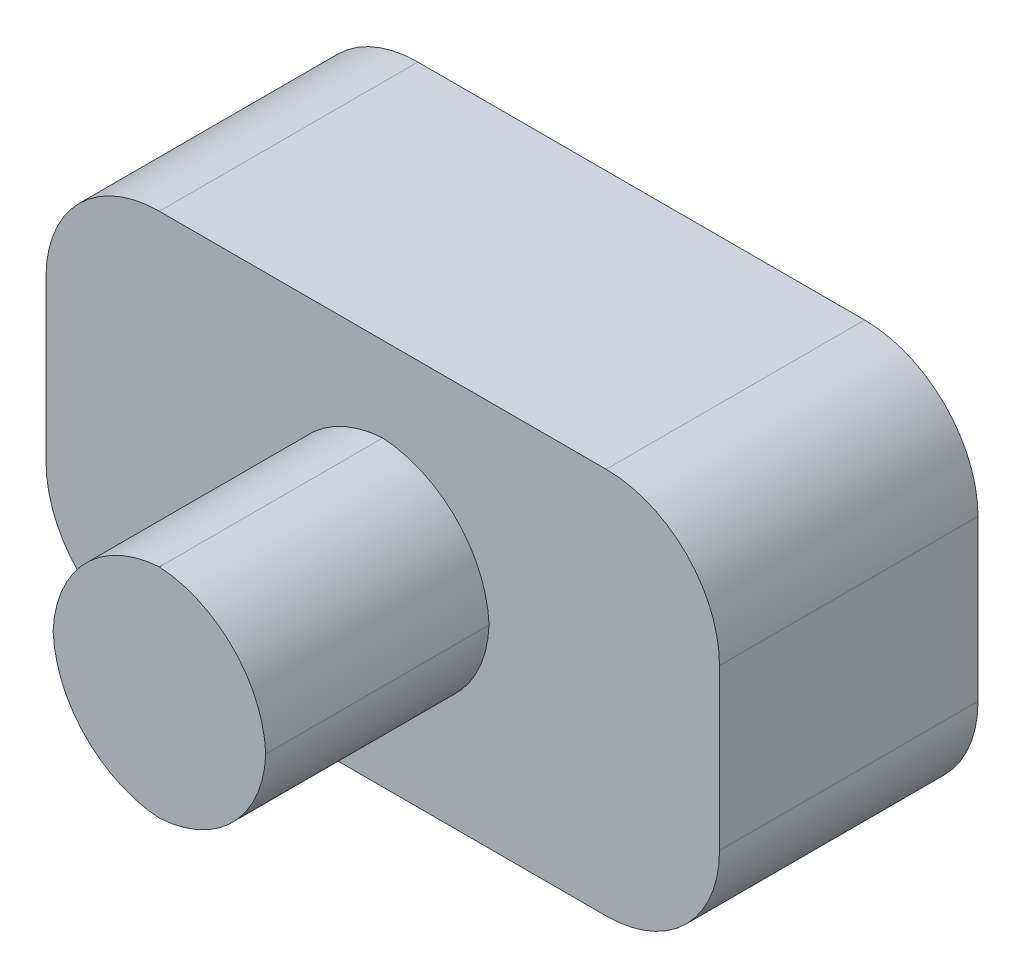
ISO-10303-21;
HEADER;
FILE_DESCRIPTION(('STEP AP214'),'2;1');
FILE_NAME('part.step','',(''),(''),'','','');
FILE_SCHEMA(('AUTOMOTIVE_DESIGN { 1 0 10303 214 1 1 1 1 }'));
ENDSEC;
DATA;
#1=APPLICATION_CONTEXT('core data for automotive mechanical design processes');
#2=APPLICATION_PROTOCOL_DEFINITION('international standard','automotive_design',2000,#1);
#3=PRODUCT_CONTEXT('',#1,'mechanical');
#4=PRODUCT('Part','Part','',(#3));
#5=PRODUCT_RELATED_PRODUCT_CATEGORY('part','',(#4));
#6=PRODUCT_DEFINITION_FORMATION('','',#4);
#7=PRODUCT_DEFINITION_CONTEXT('part definition',#1,'design');
#8=PRODUCT_DEFINITION('design','',#6,#7);
#9=PRODUCT_DEFINITION_SHAPE('','',#8);
#10=(LENGTH_UNIT() NAMED_UNIT(*) SI_UNIT(.MILLI.,.METRE.));
#11=(NAMED_UNIT(*) PLANE_ANGLE_UNIT() SI_UNIT($,.RADIAN.));
#12=(NAMED_UNIT(*) SI_UNIT($,.STERADIAN.) SOLID_ANGLE_UNIT());
#13=UNCERTAINTY_MEASURE_WITH_UNIT(LENGTH_MEASURE(1.E-05),#10,'distance_accuracy_value','');
#14=(GEOMETRIC_REPRESENTATION_CONTEXT(3) GLOBAL_UNCERTAINTY_ASSIGNED_CONTEXT((#13)) GLOBAL_UNIT_ASSIGNED_CONTEXT((#10,
#11,#12)) REPRESENTATION_CONTEXT('',''));
#15=CARTESIAN_POINT('',(0.,0.,0.));
#16=DIRECTION('',(0.,0.,1.));
#17=DIRECTION('',(1.,0.,0.));
#18=AXIS2_PLACEMENT_3D('',#15,#16,#17);
#19=CARTESIAN_POINT('',(0.,0.,0.));
#20=DIRECTION('',(0.,0.,-1.));
#21=DIRECTION('',(-1.,0.,0.));
#22=AXIS2_PLACEMENT_3D('',#19,#20,#21);
#23=PLANE('',#22);
#24=CARTESIAN_POINT('',(0.625142380952377,-0.388740952380946,0.));
#25=DIRECTION('',(0.,0.,-1.));
#26=DIRECTION('',(-1.,0.,0.));
#27=AXIS2_PLACEMENT_3D('',#24,#25,#26);
#28=CIRCLE('',#27,10.16);
#29=CARTESIAN_POINT('',(-9.52741791051804,0.,0.));
#30=VERTEX_POINT('',#29);
#31=CARTESIAN_POINT('',(0.,9.75200837908057,0.));
#32=VERTEX_POINT('',#31);
#33=EDGE_CURVE('E129',#30,#32,#28,.T.);
#34=ORIENTED_EDGE('',*,*,#33,.T.);
#35=CARTESIAN_POINT('',(-0.625142380952377,-0.388740952380946,0.));
#36=DIRECTION('',(0.,0.,-1.));
#37=DIRECTION('',(-1.,0.,0.));
#38=AXIS2_PLACEMENT_3D('',#35,#36,#37);
#39=CIRCLE('',#38,10.16);
#40=CARTESIAN_POINT('',(9.52741791051804,0.,0.));
#41=VERTEX_POINT('',#40);
#42=EDGE_CURVE('E126',#32,#41,#39,.T.);
#43=ORIENTED_EDGE('',*,*,#42,.T.);
#44=CARTESIAN_POINT('',(-0.625142380952377,0.388740952380946,0.));
#45=DIRECTION('',(0.,0.,-1.));
#46=DIRECTION('',(-1.,0.,0.));
#47=AXIS2_PLACEMENT_3D('',#44,#45,#46);
#48=CIRCLE('',#47,10.16);
#49=CARTESIAN_POINT('',(0.,-9.75200837908057,0.));
#50=VERTEX_POINT('',#49);
#51=EDGE_CURVE('E122',#41,#50,#48,.T.);
#52=ORIENTED_EDGE('',*,*,#51,.T.);
#53=CARTESIAN_POINT('',(0.625142380952377,0.388740952380946,0.));
#54=DIRECTION('',(0.,0.,-1.));
#55=DIRECTION('',(-1.,0.,0.));
#56=AXIS2_PLACEMENT_3D('',#53,#54,#55);
#57=CIRCLE('',#56,10.16);
#58=EDGE_CURVE('E124',#50,#30,#57,.T.);
#59=ORIENTED_EDGE('',*,*,#58,.T.);
#60=EDGE_LOOP('',(#34,#43,#52,#59));
#61=FACE_BOUND('',#60,.T.);
#62=ADVANCED_FACE('F77',(#61),#23,.T.);
#63=CARTESIAN_POINT('',(0.,0.,20.0152));
#64=DIRECTION('',(0.,0.,-1.));
#65=DIRECTION('',(-1.,0.,0.));
#66=AXIS2_PLACEMENT_3D('',#63,#64,#65);
#67=PLANE('',#66);
#68=CARTESIAN_POINT('',(-0.625142380952377,0.388740952380946,20.0152));
#69=DIRECTION('',(0.,0.,-1.));
#70=DIRECTION('',(-1.,0.,0.));
#71=AXIS2_PLACEMENT_3D('',#68,#69,#70);
#72=CIRCLE('',#71,10.16);
#73=CARTESIAN_POINT('',(0.,-9.75200837908057,20.0152));
#74=VERTEX_POINT('',#73);
#75=CARTESIAN_POINT('',(9.52741791051804,0.,20.0152));
#76=VERTEX_POINT('',#75);
#77=EDGE_CURVE('E101',#74,#76,#72,.F.);
#78=ORIENTED_EDGE('',*,*,#77,.T.);
#79=CARTESIAN_POINT('',(-0.625142380952377,-0.388740952380946,20.0152));
#80=DIRECTION('',(0.,0.,-1.));
#81=DIRECTION('',(-1.,0.,0.));
#82=AXIS2_PLACEMENT_3D('',#79,#80,#81);
#83=CIRCLE('',#82,10.16);
#84=CARTESIAN_POINT('',(0.,9.75200837908057,20.0152));
#85=VERTEX_POINT('',#84);
#86=EDGE_CURVE('E13',#76,#85,#83,.F.);
#87=ORIENTED_EDGE('',*,*,#86,.T.);
#88=CARTESIAN_POINT('',(0.625142380952377,-0.388740952380946,20.0152));
#89=DIRECTION('',(0.,0.,-1.));
#90=DIRECTION('',(-1.,0.,0.));
#91=AXIS2_PLACEMENT_3D('',#88,#89,#90);
#92=CIRCLE('',#91,10.16);
#93=CARTESIAN_POINT('',(-9.52741791051804,0.,20.0152));
#94=VERTEX_POINT('',#93);
#95=EDGE_CURVE('E86',#85,#94,#92,.F.);
#96=ORIENTED_EDGE('',*,*,#95,.T.);
#97=CARTESIAN_POINT('',(0.625142380952377,0.388740952380946,20.0152));
#98=DIRECTION('',(0.,0.,-1.));
#99=DIRECTION('',(-1.,0.,0.));
#100=AXIS2_PLACEMENT_3D('',#97,#98,#99);
#101=CIRCLE('',#100,10.16);
#102=EDGE_CURVE('E146',#94,#74,#101,.F.);
#103=ORIENTED_EDGE('',*,*,#102,.T.);
#104=EDGE_LOOP('',(#78,#87,#96,#103));
#105=FACE_BOUND('',#104,.T.);
#106=ADVANCED_FACE('F151',(#105),#67,.F.);
#107=CARTESIAN_POINT('',(0.625142380952377,0.388740952380946,20.0152));
#108=DIRECTION('',(0.,0.,-1.));
#109=DIRECTION('',(-1.,0.,0.));
#110=AXIS2_PLACEMENT_3D('',#107,#108,#109);
#111=CYLINDRICAL_SURFACE('',#110,10.16);
#112=DIRECTION('',(0.,0.,-1.));
#113=VECTOR('',#112,1.);
#114=CARTESIAN_POINT('',(-9.52741791051804,0.,10.0076));
#115=LINE('',#114,#113);
#116=EDGE_CURVE('E135',#30,#94,#115,.F.);
#117=ORIENTED_EDGE('',*,*,#116,.F.);
#118=ORIENTED_EDGE('',*,*,#58,.F.);
#119=DIRECTION('',(0.,0.,-1.));
#120=VECTOR('',#119,1.);
#121=CARTESIAN_POINT('',(0.,-9.75200837908057,10.0076));
#122=LINE('',#121,#120);
#123=EDGE_CURVE('E81',#74,#50,#122,.T.);
#124=ORIENTED_EDGE('',*,*,#123,.F.);
#125=ORIENTED_EDGE('',*,*,#102,.F.);
#126=EDGE_LOOP('',(#117,#118,#124,#125));
#127=FACE_BOUND('',#126,.T.);
#128=ADVANCED_FACE('F79',(#127),#111,.T.);
#129=CARTESIAN_POINT('',(-0.625142380952377,0.388740952380946,20.0152));
#130=DIRECTION('',(0.,0.,1.));
#131=DIRECTION('',(1.,0.,0.));
#132=AXIS2_PLACEMENT_3D('',#129,#130,#131);
#133=CYLINDRICAL_SURFACE('',#132,10.16);
#134=ORIENTED_EDGE('',*,*,#123,.T.);
#135=ORIENTED_EDGE('',*,*,#51,.F.);
#136=DIRECTION('',(0.,0.,1.));
#137=VECTOR('',#136,1.);
#138=CARTESIAN_POINT('',(9.52741791051804,0.,10.0076));
#139=LINE('',#138,#137);
#140=EDGE_CURVE('E139',#76,#41,#139,.F.);
#141=ORIENTED_EDGE('',*,*,#140,.F.);
#142=ORIENTED_EDGE('',*,*,#77,.F.);
#143=EDGE_LOOP('',(#134,#135,#141,#142));
#144=FACE_BOUND('',#143,.T.);
#145=ADVANCED_FACE('F138',(#144),#133,.T.);
#146=CARTESIAN_POINT('',(0.625142380952377,-0.388740952380946,20.0152));
#147=DIRECTION('',(0.,0.,1.));
#148=DIRECTION('',(1.,0.,0.));
#149=AXIS2_PLACEMENT_3D('',#146,#147,#148);
#150=CYLINDRICAL_SURFACE('',#149,10.16);
#151=ORIENTED_EDGE('',*,*,#116,.T.);
#152=ORIENTED_EDGE('',*,*,#95,.F.);
#153=DIRECTION('',(0.,0.,1.));
#154=VECTOR('',#153,1.);
#155=CARTESIAN_POINT('',(0.,9.75200837908057,10.0076));
#156=LINE('',#155,#154);
#157=EDGE_CURVE('E94',#32,#85,#156,.T.);
#158=ORIENTED_EDGE('',*,*,#157,.F.);
#159=ORIENTED_EDGE('',*,*,#33,.F.);
#160=EDGE_LOOP('',(#151,#152,#158,#159));
#161=FACE_BOUND('',#160,.T.);
#162=ADVANCED_FACE('F149',(#161),#150,.T.);
#163=CARTESIAN_POINT('',(-0.625142380952377,-0.388740952380946,20.0152));
#164=DIRECTION('',(0.,0.,-1.));
#165=DIRECTION('',(-1.,0.,0.));
#166=AXIS2_PLACEMENT_3D('',#163,#164,#165);
#167=CYLINDRICAL_SURFACE('',#166,10.16);
#168=ORIENTED_EDGE('',*,*,#86,.F.);
#169=ORIENTED_EDGE('',*,*,#140,.T.);
#170=ORIENTED_EDGE('',*,*,#42,.F.);
#171=ORIENTED_EDGE('',*,*,#157,.T.);
#172=EDGE_LOOP('',(#168,#169,#170,#171));
#173=FACE_BOUND('',#172,.T.);
#174=ADVANCED_FACE('F150',(#173),#167,.T.);
#175=CLOSED_SHELL('',(#62,#106,#128,#145,#162,#174));
#176=MANIFOLD_SOLID_BREP('B2',#175);
#177=CARTESIAN_POINT('',(30.1805823809524,0.,-23.1648));
#178=DIRECTION('',(-1.,0.,0.));
#179=DIRECTION('',(0.,0.,1.));
#180=AXIS2_PLACEMENT_3D('',#177,#178,#179);
#181=PLANE('',#180);
#182=DIRECTION('',(0.,-1.,0.));
#183=VECTOR('',#182,1.);
#184=CARTESIAN_POINT('',(30.1805823809524,0.,0.));
#185=LINE('',#184,#183);
#186=CARTESIAN_POINT('',(30.1805823809524,7.17610476190476,0.));
#187=VERTEX_POINT('',#186);
#188=CARTESIAN_POINT('',(30.1805823809524,-7.17610476190476,0.));
#189=VERTEX_POINT('',#188);
#190=EDGE_CURVE('E322',#187,#189,#185,.T.);
#191=ORIENTED_EDGE('',*,*,#190,.T.);
#192=DIRECTION('',(0.,0.,1.));
#193=VECTOR('',#192,1.);
#194=CARTESIAN_POINT('',(30.1805823809524,-7.17610476190476,-23.1648));
#195=LINE('',#194,#193);
#196=CARTESIAN_POINT('',(30.1805823809524,-7.17610476190476,-23.1648));
#197=VERTEX_POINT('',#196);
#198=EDGE_CURVE('E374',#189,#197,#195,.F.);
#199=ORIENTED_EDGE('',*,*,#198,.T.);
#200=DIRECTION('',(0.,-1.,0.));
#201=VECTOR('',#200,1.);
#202=CARTESIAN_POINT('',(30.1805823809524,0.,-23.1648));
#203=LINE('',#202,#201);
#204=CARTESIAN_POINT('',(30.1805823809524,7.17610476190476,-23.1648));
#205=VERTEX_POINT('',#204);
#206=EDGE_CURVE('E335',#205,#197,#203,.T.);
#207=ORIENTED_EDGE('',*,*,#206,.F.);
#208=DIRECTION('',(0.,0.,1.));
#209=VECTOR('',#208,1.);
#210=CARTESIAN_POINT('',(30.1805823809524,7.17610476190476,-23.1648));
#211=LINE('',#210,#209);
#212=EDGE_CURVE('E370',#205,#187,#211,.T.);
#213=ORIENTED_EDGE('',*,*,#212,.T.);
#214=EDGE_LOOP('',(#191,#199,#207,#213));
#215=FACE_BOUND('',#214,.T.);
#216=ADVANCED_FACE('F201',(#215),#181,.F.);
#217=CARTESIAN_POINT('',(0.,-17.3361047619048,-23.1648));
#218=DIRECTION('',(0.,-1.,0.));
#219=DIRECTION('',(0.,0.,-1.));
#220=AXIS2_PLACEMENT_3D('',#217,#218,#219);
#221=PLANE('',#220);
#222=DIRECTION('',(1.,0.,0.));
#223=VECTOR('',#222,1.);
#224=CARTESIAN_POINT('',(0.,-17.3361047619048,0.));
#225=LINE('',#224,#223);
#226=CARTESIAN_POINT('',(-20.0205823809524,-17.3361047619048,0.));
#227=VERTEX_POINT('',#226);
#228=CARTESIAN_POINT('',(20.0205823809524,-17.3361047619048,0.));
#229=VERTEX_POINT('',#228);
#230=EDGE_CURVE('E326',#227,#229,#225,.T.);
#231=ORIENTED_EDGE('',*,*,#230,.F.);
#232=DIRECTION('',(0.,0.,1.));
#233=VECTOR('',#232,1.);
#234=CARTESIAN_POINT('',(-20.0205823809524,-17.3361047619048,-23.1648));
#235=LINE('',#234,#233);
#236=CARTESIAN_POINT('',(-20.0205823809524,-17.3361047619048,-23.1648));
#237=VERTEX_POINT('',#236);
#238=EDGE_CURVE('E367',#227,#237,#235,.F.);
#239=ORIENTED_EDGE('',*,*,#238,.T.);
#240=DIRECTION('',(1.,0.,0.));
#241=VECTOR('',#240,1.);
#242=CARTESIAN_POINT('',(0.,-17.3361047619048,-23.1648));
#243=LINE('',#242,#241);
#244=CARTESIAN_POINT('',(20.0205823809524,-17.3361047619048,-23.1648));
#245=VERTEX_POINT('',#244);
#246=EDGE_CURVE('E337',#237,#245,#243,.T.);
#247=ORIENTED_EDGE('',*,*,#246,.T.);
#248=DIRECTION('',(0.,0.,1.));
#249=VECTOR('',#248,1.);
#250=CARTESIAN_POINT('',(20.0205823809524,-17.3361047619048,0.));
#251=LINE('',#250,#249);
#252=EDGE_CURVE('E363',#245,#229,#251,.T.);
#253=ORIENTED_EDGE('',*,*,#252,.T.);
#254=EDGE_LOOP('',(#231,#239,#247,#253));
#255=FACE_BOUND('',#254,.T.);
#256=ADVANCED_FACE('F454',(#255),#221,.T.);
#257=CARTESIAN_POINT('',(-30.1805823809524,0.,-23.1648));
#258=DIRECTION('',(-1.,0.,0.));
#259=DIRECTION('',(0.,0.,1.));
#260=AXIS2_PLACEMENT_3D('',#257,#258,#259);
#261=PLANE('',#260);
#262=DIRECTION('',(0.,-1.,0.));
#263=VECTOR('',#262,1.);
#264=CARTESIAN_POINT('',(-30.1805823809524,0.,0.));
#265=LINE('',#264,#263);
#266=CARTESIAN_POINT('',(-30.1805823809524,7.17610476190476,0.));
#267=VERTEX_POINT('',#266);
#268=CARTESIAN_POINT('',(-30.1805823809524,-7.17610476190476,0.));
#269=VERTEX_POINT('',#268);
#270=EDGE_CURVE('E321',#267,#269,#265,.T.);
#271=ORIENTED_EDGE('',*,*,#270,.F.);
#272=DIRECTION('',(0.,0.,1.));
#273=VECTOR('',#272,1.);
#274=CARTESIAN_POINT('',(-30.1805823809524,7.17610476190476,-23.1648));
#275=LINE('',#274,#273);
#276=CARTESIAN_POINT('',(-30.1805823809524,7.17610476190476,-23.1648));
#277=VERTEX_POINT('',#276);
#278=EDGE_CURVE('E297',#267,#277,#275,.F.);
#279=ORIENTED_EDGE('',*,*,#278,.T.);
#280=DIRECTION('',(0.,-1.,0.));
#281=VECTOR('',#280,1.);
#282=CARTESIAN_POINT('',(-30.1805823809524,0.,-23.1648));
#283=LINE('',#282,#281);
#284=CARTESIAN_POINT('',(-30.1805823809524,-7.17610476190476,-23.1648));
#285=VERTEX_POINT('',#284);
#286=EDGE_CURVE('E429',#277,#285,#283,.T.);
#287=ORIENTED_EDGE('',*,*,#286,.T.);
#288=DIRECTION('',(0.,0.,1.));
#289=VECTOR('',#288,1.);
#290=CARTESIAN_POINT('',(-30.1805823809524,-7.17610476190476,-23.1648));
#291=LINE('',#290,#289);
#292=EDGE_CURVE('E303',#285,#269,#291,.T.);
#293=ORIENTED_EDGE('',*,*,#292,.T.);
#294=EDGE_LOOP('',(#271,#279,#287,#293));
#295=FACE_BOUND('',#294,.T.);
#296=ADVANCED_FACE('F458',(#295),#261,.T.);
#297=CARTESIAN_POINT('',(0.,17.3361047619048,-23.1648));
#298=DIRECTION('',(0.,-1.,0.));
#299=DIRECTION('',(0.,0.,-1.));
#300=AXIS2_PLACEMENT_3D('',#297,#298,#299);
#301=PLANE('',#300);
#302=DIRECTION('',(1.,0.,0.));
#303=VECTOR('',#302,1.);
#304=CARTESIAN_POINT('',(0.,17.3361047619048,-23.1648));
#305=LINE('',#304,#303);
#306=CARTESIAN_POINT('',(-20.0205823809524,17.3361047619048,-23.1648));
#307=VERTEX_POINT('',#306);
#308=CARTESIAN_POINT('',(20.0205823809524,17.3361047619048,-23.1648));
#309=VERTEX_POINT('',#308);
#310=EDGE_CURVE('E313',#307,#309,#305,.T.);
#311=ORIENTED_EDGE('',*,*,#310,.F.);
#312=DIRECTION('',(0.,0.,1.));
#313=VECTOR('',#312,1.);
#314=CARTESIAN_POINT('',(-20.0205823809524,17.3361047619048,0.));
#315=LINE('',#314,#313);
#316=CARTESIAN_POINT('',(-20.0205823809524,17.3361047619048,0.));
#317=VERTEX_POINT('',#316);
#318=EDGE_CURVE('E296',#307,#317,#315,.T.);
#319=ORIENTED_EDGE('',*,*,#318,.T.);
#320=DIRECTION('',(1.,0.,0.));
#321=VECTOR('',#320,1.);
#322=CARTESIAN_POINT('',(0.,17.3361047619048,0.));
#323=LINE('',#322,#321);
#324=CARTESIAN_POINT('',(20.0205823809524,17.3361047619048,0.));
#325=VERTEX_POINT('',#324);
#326=EDGE_CURVE('E310',#317,#325,#323,.T.);
#327=ORIENTED_EDGE('',*,*,#326,.T.);
#328=DIRECTION('',(0.,0.,1.));
#329=VECTOR('',#328,1.);
#330=CARTESIAN_POINT('',(20.0205823809524,17.3361047619048,-23.1648));
#331=LINE('',#330,#329);
#332=EDGE_CURVE('E316',#325,#309,#331,.F.);
#333=ORIENTED_EDGE('',*,*,#332,.T.);
#334=EDGE_LOOP('',(#311,#319,#327,#333));
#335=FACE_BOUND('',#334,.T.);
#336=ADVANCED_FACE('F309',(#335),#301,.F.);
#337=CARTESIAN_POINT('',(0.,0.,-23.1648));
#338=DIRECTION('',(0.,0.,1.));
#339=DIRECTION('',(1.,0.,0.));
#340=AXIS2_PLACEMENT_3D('',#337,#338,#339);
#341=PLANE('',#340);
#342=CARTESIAN_POINT('',(0.625142380952379,-0.388740952380948,-23.1648));
#343=DIRECTION('',(0.,0.,1.));
#344=DIRECTION('',(1.,0.,0.));
#345=AXIS2_PLACEMENT_3D('',#342,#343,#344);
#346=CIRCLE('',#345,10.16);
#347=CARTESIAN_POINT('',(0.,9.75200837908057,-23.1648));
#348=VERTEX_POINT('',#347);
#349=CARTESIAN_POINT('',(-9.52741791051804,0.,-23.1648));
#350=VERTEX_POINT('',#349);
#351=EDGE_CURVE('E381',#348,#350,#346,.T.);
#352=ORIENTED_EDGE('',*,*,#351,.T.);
#353=CARTESIAN_POINT('',(0.625142380952379,0.388740952380948,-23.1648));
#354=DIRECTION('',(0.,0.,1.));
#355=DIRECTION('',(1.,0.,0.));
#356=AXIS2_PLACEMENT_3D('',#353,#354,#355);
#357=CIRCLE('',#356,10.16);
#358=CARTESIAN_POINT('',(0.,-9.75200837908057,-23.1648));
#359=VERTEX_POINT('',#358);
#360=EDGE_CURVE('E75',#350,#359,#357,.T.);
#361=ORIENTED_EDGE('',*,*,#360,.T.);
#362=CARTESIAN_POINT('',(-0.625142380952379,0.388740952380948,-23.1648));
#363=DIRECTION('',(0.,0.,1.));
#364=DIRECTION('',(1.,0.,0.));
#365=AXIS2_PLACEMENT_3D('',#362,#363,#364);
#366=CIRCLE('',#365,10.16);
#367=CARTESIAN_POINT('',(9.52741791051804,0.,-23.1648));
#368=VERTEX_POINT('',#367);
#369=EDGE_CURVE('E392',#359,#368,#366,.T.);
#370=ORIENTED_EDGE('',*,*,#369,.T.);
#371=CARTESIAN_POINT('',(-0.625142380952379,-0.388740952380948,-23.1648));
#372=DIRECTION('',(0.,0.,1.));
#373=DIRECTION('',(1.,0.,0.));
#374=AXIS2_PLACEMENT_3D('',#371,#372,#373);
#375=CIRCLE('',#374,10.16);
#376=EDGE_CURVE('E387',#368,#348,#375,.T.);
#377=ORIENTED_EDGE('',*,*,#376,.T.);
#378=EDGE_LOOP('',(#352,#361,#370,#377));
#379=FACE_BOUND('',#378,.T.);
#380=ORIENTED_EDGE('',*,*,#286,.F.);
#381=CARTESIAN_POINT('',(-20.0205823809524,7.17610476190476,-23.1648));
#382=DIRECTION('',(0.,0.,1.));
#383=DIRECTION('',(1.,0.,0.));
#384=AXIS2_PLACEMENT_3D('',#381,#382,#383);
#385=CIRCLE('',#384,10.16);
#386=EDGE_CURVE('E360',#277,#307,#385,.F.);
#387=ORIENTED_EDGE('',*,*,#386,.T.);
#388=ORIENTED_EDGE('',*,*,#310,.T.);
#389=CARTESIAN_POINT('',(20.0205823809524,7.17610476190476,-23.1648));
#390=DIRECTION('',(0.,0.,1.));
#391=DIRECTION('',(1.,0.,0.));
#392=AXIS2_PLACEMENT_3D('',#389,#390,#391);
#393=CIRCLE('',#392,10.16);
#394=EDGE_CURVE('E351',#309,#205,#393,.F.);
#395=ORIENTED_EDGE('',*,*,#394,.T.);
#396=ORIENTED_EDGE('',*,*,#206,.T.);
#397=CARTESIAN_POINT('',(20.0205823809524,-7.17610476190476,-23.1648));
#398=DIRECTION('',(0.,0.,1.));
#399=DIRECTION('',(1.,0.,0.));
#400=AXIS2_PLACEMENT_3D('',#397,#398,#399);
#401=CIRCLE('',#400,10.16);
#402=EDGE_CURVE('E354',#197,#245,#401,.F.);
#403=ORIENTED_EDGE('',*,*,#402,.T.);
#404=ORIENTED_EDGE('',*,*,#246,.F.);
#405=CARTESIAN_POINT('',(-20.0205823809524,-7.17610476190476,-23.1648));
#406=DIRECTION('',(0.,0.,1.));
#407=DIRECTION('',(1.,0.,0.));
#408=AXIS2_PLACEMENT_3D('',#405,#406,#407);
#409=CIRCLE('',#408,10.16);
#410=EDGE_CURVE('E357',#237,#285,#409,.F.);
#411=ORIENTED_EDGE('',*,*,#410,.T.);
#412=EDGE_LOOP('',(#380,#387,#388,#395,#396,#403,#404,#411));
#413=FACE_BOUND('',#412,.T.);
#414=ADVANCED_FACE('F423',(#379,#413),#341,.F.);
#415=CARTESIAN_POINT('',(0.,0.,0.));
#416=DIRECTION('',(0.,0.,1.));
#417=DIRECTION('',(1.,0.,0.));
#418=AXIS2_PLACEMENT_3D('',#415,#416,#417);
#419=PLANE('',#418);
#420=CARTESIAN_POINT('',(-0.625142380952379,0.388740952380948,0.));
#421=DIRECTION('',(0.,0.,1.));
#422=DIRECTION('',(1.,0.,0.));
#423=AXIS2_PLACEMENT_3D('',#420,#421,#422);
#424=CIRCLE('',#423,10.16);
#425=CARTESIAN_POINT('',(9.52741791051804,0.,0.));
#426=VERTEX_POINT('',#425);
#427=CARTESIAN_POINT('',(0.,-9.75200837908057,0.));
#428=VERTEX_POINT('',#427);
#429=EDGE_CURVE('E225',#426,#428,#424,.F.);
#430=ORIENTED_EDGE('',*,*,#429,.T.);
#431=CARTESIAN_POINT('',(0.625142380952379,0.388740952380948,0.));
#432=DIRECTION('',(0.,0.,1.));
#433=DIRECTION('',(1.,0.,0.));
#434=AXIS2_PLACEMENT_3D('',#431,#432,#433);
#435=CIRCLE('',#434,10.16);
#436=CARTESIAN_POINT('',(-9.52741791051804,0.,0.));
#437=VERTEX_POINT('',#436);
#438=EDGE_CURVE('E211',#428,#437,#435,.F.);
#439=ORIENTED_EDGE('',*,*,#438,.T.);
#440=CARTESIAN_POINT('',(0.625142380952379,-0.388740952380948,0.));
#441=DIRECTION('',(0.,0.,1.));
#442=DIRECTION('',(1.,0.,0.));
#443=AXIS2_PLACEMENT_3D('',#440,#441,#442);
#444=CIRCLE('',#443,10.16);
#445=CARTESIAN_POINT('',(0.,9.75200837908057,0.));
#446=VERTEX_POINT('',#445);
#447=EDGE_CURVE('E377',#437,#446,#444,.F.);
#448=ORIENTED_EDGE('',*,*,#447,.T.);
#449=CARTESIAN_POINT('',(-0.625142380952379,-0.388740952380948,0.));
#450=DIRECTION('',(0.,0.,1.));
#451=DIRECTION('',(1.,0.,0.));
#452=AXIS2_PLACEMENT_3D('',#449,#450,#451);
#453=CIRCLE('',#452,10.16);
#454=EDGE_CURVE('E384',#446,#426,#453,.F.);
#455=ORIENTED_EDGE('',*,*,#454,.T.);
#456=EDGE_LOOP('',(#430,#439,#448,#455));
#457=FACE_BOUND('',#456,.T.);
#458=ORIENTED_EDGE('',*,*,#326,.F.);
#459=CARTESIAN_POINT('',(-20.0205823809524,7.17610476190476,0.));
#460=DIRECTION('',(0.,0.,1.));
#461=DIRECTION('',(1.,0.,0.));
#462=AXIS2_PLACEMENT_3D('',#459,#460,#461);
#463=CIRCLE('',#462,10.16);
#464=EDGE_CURVE('E292',#317,#267,#463,.T.);
#465=ORIENTED_EDGE('',*,*,#464,.T.);
#466=ORIENTED_EDGE('',*,*,#270,.T.);
#467=CARTESIAN_POINT('',(-20.0205823809524,-7.17610476190476,0.));
#468=DIRECTION('',(0.,0.,1.));
#469=DIRECTION('',(1.,0.,0.));
#470=AXIS2_PLACEMENT_3D('',#467,#468,#469);
#471=CIRCLE('',#470,10.16);
#472=EDGE_CURVE('E304',#269,#227,#471,.T.);
#473=ORIENTED_EDGE('',*,*,#472,.T.);
#474=ORIENTED_EDGE('',*,*,#230,.T.);
#475=CARTESIAN_POINT('',(20.0205823809524,-7.17610476190476,0.));
#476=DIRECTION('',(0.,0.,1.));
#477=DIRECTION('',(1.,0.,0.));
#478=AXIS2_PLACEMENT_3D('',#475,#476,#477);
#479=CIRCLE('',#478,10.16);
#480=EDGE_CURVE('E341',#229,#189,#479,.T.);
#481=ORIENTED_EDGE('',*,*,#480,.T.);
#482=ORIENTED_EDGE('',*,*,#190,.F.);
#483=CARTESIAN_POINT('',(20.0205823809524,7.17610476190476,0.));
#484=DIRECTION('',(0.,0.,1.));
#485=DIRECTION('',(1.,0.,0.));
#486=AXIS2_PLACEMENT_3D('',#483,#484,#485);
#487=CIRCLE('',#486,10.16);
#488=EDGE_CURVE('E315',#187,#325,#487,.T.);
#489=ORIENTED_EDGE('',*,*,#488,.T.);
#490=EDGE_LOOP('',(#458,#465,#466,#473,#474,#481,#482,#489));
#491=FACE_BOUND('',#490,.T.);
#492=ADVANCED_FACE('F318',(#457,#491),#419,.T.);
#493=CARTESIAN_POINT('',(-0.625142380952379,0.388740952380948,-23.1648));
#494=DIRECTION('',(0.,0.,1.));
#495=DIRECTION('',(1.,0.,0.));
#496=AXIS2_PLACEMENT_3D('',#493,#494,#495);
#497=CYLINDRICAL_SURFACE('',#496,10.16);
#498=DIRECTION('',(0.,0.,1.));
#499=VECTOR('',#498,1.);
#500=CARTESIAN_POINT('',(0.,-9.75200837908057,-11.5824));
#501=LINE('',#500,#499);
#502=EDGE_CURVE('E402',#428,#359,#501,.F.);
#503=ORIENTED_EDGE('',*,*,#502,.F.);
#504=ORIENTED_EDGE('',*,*,#429,.F.);
#505=DIRECTION('',(0.,0.,1.));
#506=VECTOR('',#505,1.);
#507=CARTESIAN_POINT('',(9.52741791051804,0.,-11.5824));
#508=LINE('',#507,#506);
#509=EDGE_CURVE('E205',#368,#426,#508,.T.);
#510=ORIENTED_EDGE('',*,*,#509,.F.);
#511=ORIENTED_EDGE('',*,*,#369,.F.);
#512=EDGE_LOOP('',(#503,#504,#510,#511));
#513=FACE_BOUND('',#512,.T.);
#514=ADVANCED_FACE('F416',(#513),#497,.F.);
#515=CARTESIAN_POINT('',(-0.625142380952379,-0.388740952380948,-23.1648));
#516=DIRECTION('',(0.,0.,-1.));
#517=DIRECTION('',(-1.,0.,0.));
#518=AXIS2_PLACEMENT_3D('',#515,#516,#517);
#519=CYLINDRICAL_SURFACE('',#518,10.16);
#520=ORIENTED_EDGE('',*,*,#509,.T.);
#521=ORIENTED_EDGE('',*,*,#454,.F.);
#522=DIRECTION('',(0.,0.,-1.));
#523=VECTOR('',#522,1.);
#524=CARTESIAN_POINT('',(0.,9.75200837908057,-11.5824));
#525=LINE('',#524,#523);
#526=EDGE_CURVE('E400',#348,#446,#525,.F.);
#527=ORIENTED_EDGE('',*,*,#526,.F.);
#528=ORIENTED_EDGE('',*,*,#376,.F.);
#529=EDGE_LOOP('',(#520,#521,#527,#528));
#530=FACE_BOUND('',#529,.T.);
#531=ADVANCED_FACE('F413',(#530),#519,.F.);
#532=CARTESIAN_POINT('',(0.625142380952379,0.388740952380948,-23.1648));
#533=DIRECTION('',(0.,0.,-1.));
#534=DIRECTION('',(-1.,0.,0.));
#535=AXIS2_PLACEMENT_3D('',#532,#533,#534);
#536=CYLINDRICAL_SURFACE('',#535,10.16);
#537=ORIENTED_EDGE('',*,*,#502,.T.);
#538=ORIENTED_EDGE('',*,*,#360,.F.);
#539=DIRECTION('',(0.,0.,-1.));
#540=VECTOR('',#539,1.);
#541=CARTESIAN_POINT('',(-9.52741791051804,0.,-11.5824));
#542=LINE('',#541,#540);
#543=EDGE_CURVE('E397',#437,#350,#542,.T.);
#544=ORIENTED_EDGE('',*,*,#543,.F.);
#545=ORIENTED_EDGE('',*,*,#438,.F.);
#546=EDGE_LOOP('',(#537,#538,#544,#545));
#547=FACE_BOUND('',#546,.T.);
#548=ADVANCED_FACE('F418',(#547),#536,.F.);
#549=CARTESIAN_POINT('',(0.625142380952379,-0.388740952380948,-23.1648));
#550=DIRECTION('',(0.,0.,1.));
#551=DIRECTION('',(1.,0.,0.));
#552=AXIS2_PLACEMENT_3D('',#549,#550,#551);
#553=CYLINDRICAL_SURFACE('',#552,10.16);
#554=ORIENTED_EDGE('',*,*,#351,.F.);
#555=ORIENTED_EDGE('',*,*,#526,.T.);
#556=ORIENTED_EDGE('',*,*,#447,.F.);
#557=ORIENTED_EDGE('',*,*,#543,.T.);
#558=EDGE_LOOP('',(#554,#555,#556,#557));
#559=FACE_BOUND('',#558,.T.);
#560=ADVANCED_FACE('F422',(#559),#553,.F.);
#561=CARTESIAN_POINT('',(-20.0205823809524,7.17610476190476,-23.1648));
#562=DIRECTION('',(0.,0.,-1.));
#563=DIRECTION('',(-1.,0.,0.));
#564=AXIS2_PLACEMENT_3D('',#561,#562,#563);
#565=CYLINDRICAL_SURFACE('',#564,10.16);
#566=ORIENTED_EDGE('',*,*,#386,.F.);
#567=ORIENTED_EDGE('',*,*,#278,.F.);
#568=ORIENTED_EDGE('',*,*,#464,.F.);
#569=ORIENTED_EDGE('',*,*,#318,.F.);
#570=EDGE_LOOP('',(#566,#567,#568,#569));
#571=FACE_BOUND('',#570,.T.);
#572=ADVANCED_FACE('F295',(#571),#565,.T.);
#573=CARTESIAN_POINT('',(-20.0205823809524,-7.17610476190476,-23.1648));
#574=DIRECTION('',(0.,0.,1.));
#575=DIRECTION('',(1.,0.,0.));
#576=AXIS2_PLACEMENT_3D('',#573,#574,#575);
#577=CYLINDRICAL_SURFACE('',#576,10.16);
#578=ORIENTED_EDGE('',*,*,#410,.F.);
#579=ORIENTED_EDGE('',*,*,#238,.F.);
#580=ORIENTED_EDGE('',*,*,#472,.F.);
#581=ORIENTED_EDGE('',*,*,#292,.F.);
#582=EDGE_LOOP('',(#578,#579,#580,#581));
#583=FACE_BOUND('',#582,.T.);
#584=ADVANCED_FACE('F457',(#583),#577,.T.);
#585=CARTESIAN_POINT('',(20.0205823809524,-7.17610476190476,-23.1648));
#586=DIRECTION('',(0.,0.,-1.));
#587=DIRECTION('',(-1.,0.,0.));
#588=AXIS2_PLACEMENT_3D('',#585,#586,#587);
#589=CYLINDRICAL_SURFACE('',#588,10.16);
#590=ORIENTED_EDGE('',*,*,#402,.F.);
#591=ORIENTED_EDGE('',*,*,#198,.F.);
#592=ORIENTED_EDGE('',*,*,#480,.F.);
#593=ORIENTED_EDGE('',*,*,#252,.F.);
#594=EDGE_LOOP('',(#590,#591,#592,#593));
#595=FACE_BOUND('',#594,.T.);
#596=ADVANCED_FACE('F451',(#595),#589,.T.);
#597=CARTESIAN_POINT('',(20.0205823809524,7.17610476190476,-23.1648));
#598=DIRECTION('',(0.,0.,1.));
#599=DIRECTION('',(1.,0.,0.));
#600=AXIS2_PLACEMENT_3D('',#597,#598,#599);
#601=CYLINDRICAL_SURFACE('',#600,10.16);
#602=ORIENTED_EDGE('',*,*,#394,.F.);
#603=ORIENTED_EDGE('',*,*,#332,.F.);
#604=ORIENTED_EDGE('',*,*,#488,.F.);
#605=ORIENTED_EDGE('',*,*,#212,.F.);
#606=EDGE_LOOP('',(#602,#603,#604,#605));
#607=FACE_BOUND('',#606,.T.);
#608=ADVANCED_FACE('F203',(#607),#601,.T.);
#609=CLOSED_SHELL('',(#216,#256,#296,#336,#414,#492,#514,#531,#548,#560,#572,#584,#596,#608));
#610=MANIFOLD_SOLID_BREP('B7',#609);
#611=ADVANCED_BREP_SHAPE_REPRESENTATION('',(#18,#176,#610),#14);
#612=SHAPE_DEFINITION_REPRESENTATION(#9,#611);
ENDSEC;
END-ISO-10303-21;
